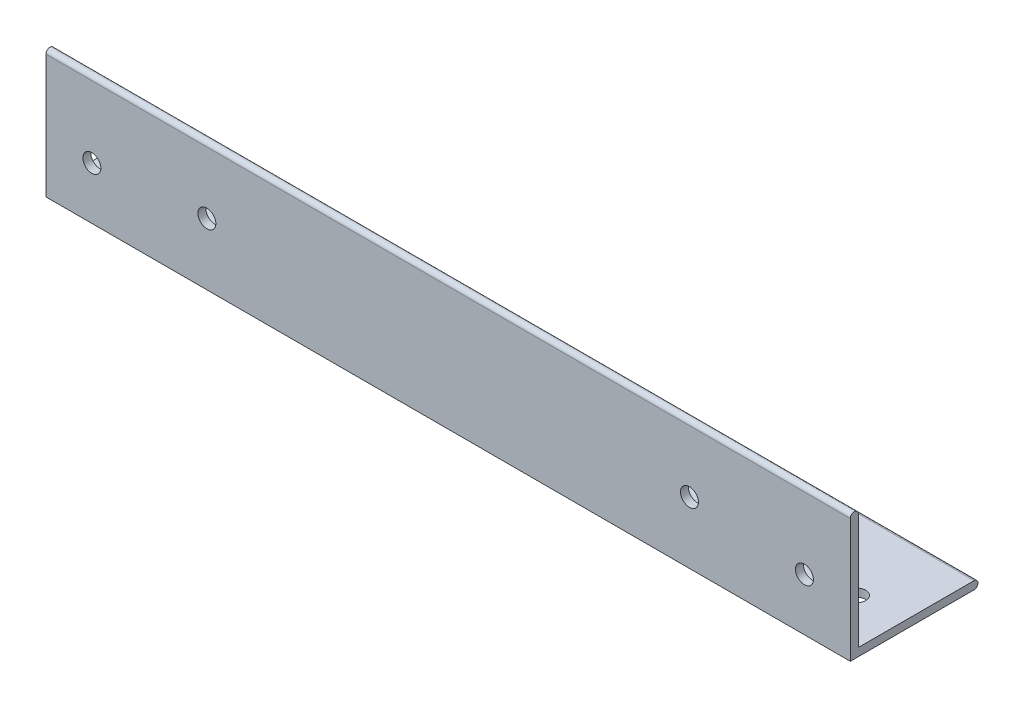
ISO-10303-21;
HEADER;
FILE_DESCRIPTION(('STEP AP214'),'2;1');
FILE_NAME('part.step','',(''),(''),'','','');
FILE_SCHEMA(('AUTOMOTIVE_DESIGN { 1 0 10303 214 1 1 1 1 }'));
ENDSEC;
DATA;
#1=APPLICATION_CONTEXT('core data for automotive mechanical design processes');
#2=APPLICATION_PROTOCOL_DEFINITION('international standard','automotive_design',2000,#1);
#3=PRODUCT_CONTEXT('',#1,'mechanical');
#4=PRODUCT('Part','Part','',(#3));
#5=PRODUCT_RELATED_PRODUCT_CATEGORY('part','',(#4));
#6=PRODUCT_DEFINITION_FORMATION('','',#4);
#7=PRODUCT_DEFINITION_CONTEXT('part definition',#1,'design');
#8=PRODUCT_DEFINITION('design','',#6,#7);
#9=PRODUCT_DEFINITION_SHAPE('','',#8);
#10=(LENGTH_UNIT() NAMED_UNIT(*) SI_UNIT(.MILLI.,.METRE.));
#11=(NAMED_UNIT(*) PLANE_ANGLE_UNIT() SI_UNIT($,.RADIAN.));
#12=(NAMED_UNIT(*) SI_UNIT($,.STERADIAN.) SOLID_ANGLE_UNIT());
#13=UNCERTAINTY_MEASURE_WITH_UNIT(LENGTH_MEASURE(1.E-05),#10,'distance_accuracy_value','');
#14=(GEOMETRIC_REPRESENTATION_CONTEXT(3) GLOBAL_UNCERTAINTY_ASSIGNED_CONTEXT((#13)) GLOBAL_UNIT_ASSIGNED_CONTEXT((#10,
#11,#12)) REPRESENTATION_CONTEXT('',''));
#15=CARTESIAN_POINT('',(0.,0.,0.));
#16=DIRECTION('',(0.,0.,1.));
#17=DIRECTION('',(1.,0.,0.));
#18=AXIS2_PLACEMENT_3D('',#15,#16,#17);
#19=CARTESIAN_POINT('',(160.,0.793749999999999,-24.60625));
#20=DIRECTION('',(-1.,0.,0.));
#21=DIRECTION('',(0.,0.,1.));
#22=AXIS2_PLACEMENT_3D('',#19,#20,#21);
#23=CYLINDRICAL_SURFACE('',#22,0.793749999999999);
#24=DIRECTION('',(-1.,0.,0.));
#25=VECTOR('',#24,1.);
#26=CARTESIAN_POINT('',(160.,1.5875,-24.60625));
#27=LINE('',#26,#25);
#28=CARTESIAN_POINT('',(160.,1.5875,-24.60625));
#29=VERTEX_POINT('',#28);
#30=CARTESIAN_POINT('',(0.,1.5875,-24.60625));
#31=VERTEX_POINT('',#30);
#32=EDGE_CURVE('E138',#29,#31,#27,.T.);
#33=ORIENTED_EDGE('',*,*,#32,.F.);
#34=CARTESIAN_POINT('',(160.,0.793749999999999,-24.60625));
#35=DIRECTION('',(-1.,0.,0.));
#36=DIRECTION('',(0.,0.,1.));
#37=AXIS2_PLACEMENT_3D('',#34,#35,#36);
#38=CIRCLE('',#37,0.793749999999999);
#39=CARTESIAN_POINT('',(160.,0.,-24.60625));
#40=VERTEX_POINT('',#39);
#41=EDGE_CURVE('E47',#40,#29,#38,.F.);
#42=ORIENTED_EDGE('',*,*,#41,.F.);
#43=DIRECTION('',(-1.,0.,0.));
#44=VECTOR('',#43,1.);
#45=CARTESIAN_POINT('',(160.,0.,-24.60625));
#46=LINE('',#45,#44);
#47=CARTESIAN_POINT('',(0.,0.,-24.60625));
#48=VERTEX_POINT('',#47);
#49=EDGE_CURVE('E140',#48,#40,#46,.F.);
#50=ORIENTED_EDGE('',*,*,#49,.F.);
#51=CARTESIAN_POINT('',(0.,0.793749999999999,-24.60625));
#52=DIRECTION('',(-1.,0.,0.));
#53=DIRECTION('',(0.,0.,1.));
#54=AXIS2_PLACEMENT_3D('',#51,#52,#53);
#55=CIRCLE('',#54,0.793749999999999);
#56=EDGE_CURVE('E11',#31,#48,#55,.T.);
#57=ORIENTED_EDGE('',*,*,#56,.F.);
#58=EDGE_LOOP('',(#33,#42,#50,#57));
#59=FACE_BOUND('',#58,.T.);
#60=ADVANCED_FACE('F38',(#59),#23,.T.);
#61=CARTESIAN_POINT('',(160.,24.60625,-0.79375));
#62=DIRECTION('',(-1.,0.,0.));
#63=DIRECTION('',(0.,0.,1.));
#64=AXIS2_PLACEMENT_3D('',#61,#62,#63);
#65=CYLINDRICAL_SURFACE('',#64,0.79375);
#66=DIRECTION('',(-1.,0.,0.));
#67=VECTOR('',#66,1.);
#68=CARTESIAN_POINT('',(160.,24.60625,0.));
#69=LINE('',#68,#67);
#70=CARTESIAN_POINT('',(160.,24.60625,0.));
#71=VERTEX_POINT('',#70);
#72=CARTESIAN_POINT('',(0.,24.60625,0.));
#73=VERTEX_POINT('',#72);
#74=EDGE_CURVE('E108',#71,#73,#69,.T.);
#75=ORIENTED_EDGE('',*,*,#74,.F.);
#76=CARTESIAN_POINT('',(160.,24.60625,-0.79375));
#77=DIRECTION('',(-1.,0.,0.));
#78=DIRECTION('',(0.,0.,1.));
#79=AXIS2_PLACEMENT_3D('',#76,#77,#78);
#80=CIRCLE('',#79,0.79375);
#81=CARTESIAN_POINT('',(160.,24.60625,-1.5875));
#82=VERTEX_POINT('',#81);
#83=EDGE_CURVE('E134',#82,#71,#80,.F.);
#84=ORIENTED_EDGE('',*,*,#83,.F.);
#85=DIRECTION('',(-1.,0.,0.));
#86=VECTOR('',#85,1.);
#87=CARTESIAN_POINT('',(160.,24.60625,-1.5875));
#88=LINE('',#87,#86);
#89=CARTESIAN_POINT('',(0.,24.60625,-1.5875));
#90=VERTEX_POINT('',#89);
#91=EDGE_CURVE('E114',#90,#82,#88,.F.);
#92=ORIENTED_EDGE('',*,*,#91,.F.);
#93=CARTESIAN_POINT('',(0.,24.60625,-0.79375));
#94=DIRECTION('',(-1.,0.,0.));
#95=DIRECTION('',(0.,0.,1.));
#96=AXIS2_PLACEMENT_3D('',#93,#94,#95);
#97=CIRCLE('',#96,0.79375);
#98=EDGE_CURVE('E136',#73,#90,#97,.T.);
#99=ORIENTED_EDGE('',*,*,#98,.F.);
#100=EDGE_LOOP('',(#75,#84,#92,#99));
#101=FACE_BOUND('',#100,.T.);
#102=ADVANCED_FACE('F199',(#101),#65,.T.);
#103=CARTESIAN_POINT('',(160.,0.,-25.4));
#104=DIRECTION('',(0.,1.,0.));
#105=DIRECTION('',(0.,0.,1.));
#106=AXIS2_PLACEMENT_3D('',#103,#104,#105);
#107=PLANE('',#106);
#108=CARTESIAN_POINT('',(50.05,0.,-10.915));
#109=DIRECTION('',(0.,-1.,0.));
#110=DIRECTION('',(0.,0.,-1.));
#111=AXIS2_PLACEMENT_3D('',#108,#109,#110);
#112=CIRCLE('',#111,2.38125);
#113=CARTESIAN_POINT('',(50.05,0.,-13.29625));
#114=VERTEX_POINT('',#113);
#115=EDGE_CURVE('E150',#114,#114,#112,.T.);
#116=ORIENTED_EDGE('',*,*,#115,.F.);
#117=EDGE_LOOP('',(#116));
#118=FACE_BOUND('',#117,.T.);
#119=CARTESIAN_POINT('',(109.95,0.,-10.915));
#120=DIRECTION('',(0.,-1.,0.));
#121=DIRECTION('',(0.,0.,-1.));
#122=AXIS2_PLACEMENT_3D('',#119,#120,#121);
#123=CIRCLE('',#122,2.38125000000001);
#124=CARTESIAN_POINT('',(109.95,0.,-13.29625));
#125=VERTEX_POINT('',#124);
#126=EDGE_CURVE('E156',#125,#125,#123,.T.);
#127=ORIENTED_EDGE('',*,*,#126,.F.);
#128=EDGE_LOOP('',(#127));
#129=FACE_BOUND('',#128,.T.);
#130=CARTESIAN_POINT('',(9.13,0.,-10.41));
#131=DIRECTION('',(0.,-1.,0.));
#132=DIRECTION('',(0.,0.,1.));
#133=AXIS2_PLACEMENT_3D('',#130,#131,#132);
#134=CIRCLE('',#133,1.785);
#135=CARTESIAN_POINT('',(9.13,0.,-8.625));
#136=VERTEX_POINT('',#135);
#137=EDGE_CURVE('E146',#136,#136,#134,.T.);
#138=ORIENTED_EDGE('',*,*,#137,.F.);
#139=EDGE_LOOP('',(#138));
#140=FACE_BOUND('',#139,.T.);
#141=CARTESIAN_POINT('',(150.87,0.,-10.41));
#142=DIRECTION('',(0.,-1.,0.));
#143=DIRECTION('',(0.,0.,-1.));
#144=AXIS2_PLACEMENT_3D('',#141,#142,#143);
#145=CIRCLE('',#144,1.78500000000001);
#146=CARTESIAN_POINT('',(150.87,0.,-12.195));
#147=VERTEX_POINT('',#146);
#148=EDGE_CURVE('E184',#147,#147,#145,.T.);
#149=ORIENTED_EDGE('',*,*,#148,.F.);
#150=EDGE_LOOP('',(#149));
#151=FACE_BOUND('',#150,.T.);
#152=DIRECTION('',(0.,0.,-1.));
#153=VECTOR('',#152,1.);
#154=CARTESIAN_POINT('',(0.,0.,-25.4));
#155=LINE('',#154,#153);
#156=CARTESIAN_POINT('',(0.,0.,0.));
#157=VERTEX_POINT('',#156);
#158=EDGE_CURVE('E120',#157,#48,#155,.T.);
#159=ORIENTED_EDGE('',*,*,#158,.T.);
#160=ORIENTED_EDGE('',*,*,#49,.T.);
#161=DIRECTION('',(0.,0.,-1.));
#162=VECTOR('',#161,1.);
#163=CARTESIAN_POINT('',(160.,0.,-25.4));
#164=LINE('',#163,#162);
#165=CARTESIAN_POINT('',(160.,0.,0.));
#166=VERTEX_POINT('',#165);
#167=EDGE_CURVE('E99',#166,#40,#164,.T.);
#168=ORIENTED_EDGE('',*,*,#167,.F.);
#169=DIRECTION('',(-1.,0.,0.));
#170=VECTOR('',#169,1.);
#171=CARTESIAN_POINT('',(160.,0.,0.));
#172=LINE('',#171,#170);
#173=EDGE_CURVE('E109',#166,#157,#172,.T.);
#174=ORIENTED_EDGE('',*,*,#173,.T.);
#175=EDGE_LOOP('',(#159,#160,#168,#174));
#176=FACE_BOUND('',#175,.T.);
#177=ADVANCED_FACE('F194',(#118,#129,#140,#151,#176),#107,.F.);
#178=CARTESIAN_POINT('',(160.,1.5875,-1.5875));
#179=DIRECTION('',(0.,-1.,0.));
#180=DIRECTION('',(0.,0.,-1.));
#181=AXIS2_PLACEMENT_3D('',#178,#179,#180);
#182=PLANE('',#181);
#183=CARTESIAN_POINT('',(50.05,1.5875,-10.915));
#184=DIRECTION('',(0.,-1.,0.));
#185=DIRECTION('',(0.,0.,-1.));
#186=AXIS2_PLACEMENT_3D('',#183,#184,#185);
#187=CIRCLE('',#186,2.38125);
#188=CARTESIAN_POINT('',(50.05,1.5875,-13.29625));
#189=VERTEX_POINT('',#188);
#190=EDGE_CURVE('E42',#189,#189,#187,.T.);
#191=ORIENTED_EDGE('',*,*,#190,.T.);
#192=EDGE_LOOP('',(#191));
#193=FACE_BOUND('',#192,.T.);
#194=CARTESIAN_POINT('',(109.95,1.5875,-10.915));
#195=DIRECTION('',(0.,-1.,0.));
#196=DIRECTION('',(0.,0.,-1.));
#197=AXIS2_PLACEMENT_3D('',#194,#195,#196);
#198=CIRCLE('',#197,2.38125000000001);
#199=CARTESIAN_POINT('',(109.95,1.5875,-13.29625));
#200=VERTEX_POINT('',#199);
#201=EDGE_CURVE('E148',#200,#200,#198,.T.);
#202=ORIENTED_EDGE('',*,*,#201,.T.);
#203=EDGE_LOOP('',(#202));
#204=FACE_BOUND('',#203,.T.);
#205=CARTESIAN_POINT('',(9.13,1.5875,-10.41));
#206=DIRECTION('',(0.,-1.,0.));
#207=DIRECTION('',(0.,0.,-1.));
#208=AXIS2_PLACEMENT_3D('',#205,#206,#207);
#209=CIRCLE('',#208,1.785);
#210=CARTESIAN_POINT('',(9.13,1.5875,-12.195));
#211=VERTEX_POINT('',#210);
#212=EDGE_CURVE('E123',#211,#211,#209,.T.);
#213=ORIENTED_EDGE('',*,*,#212,.T.);
#214=EDGE_LOOP('',(#213));
#215=FACE_BOUND('',#214,.T.);
#216=CARTESIAN_POINT('',(150.87,1.5875,-10.41));
#217=DIRECTION('',(0.,-1.,0.));
#218=DIRECTION('',(0.,0.,-1.));
#219=AXIS2_PLACEMENT_3D('',#216,#217,#218);
#220=CIRCLE('',#219,1.78500000000001);
#221=CARTESIAN_POINT('',(150.87,1.5875,-12.195));
#222=VERTEX_POINT('',#221);
#223=EDGE_CURVE('E143',#222,#222,#220,.T.);
#224=ORIENTED_EDGE('',*,*,#223,.T.);
#225=EDGE_LOOP('',(#224));
#226=FACE_BOUND('',#225,.T.);
#227=DIRECTION('',(0.,0.,1.));
#228=VECTOR('',#227,1.);
#229=CARTESIAN_POINT('',(160.,1.5875,-1.5875));
#230=LINE('',#229,#228);
#231=CARTESIAN_POINT('',(160.,1.5875,-1.5875));
#232=VERTEX_POINT('',#231);
#233=EDGE_CURVE('E91',#29,#232,#230,.T.);
#234=ORIENTED_EDGE('',*,*,#233,.F.);
#235=ORIENTED_EDGE('',*,*,#32,.T.);
#236=DIRECTION('',(0.,0.,1.));
#237=VECTOR('',#236,1.);
#238=CARTESIAN_POINT('',(0.,1.5875,-1.5875));
#239=LINE('',#238,#237);
#240=CARTESIAN_POINT('',(0.,1.5875,-1.5875));
#241=VERTEX_POINT('',#240);
#242=EDGE_CURVE('E104',#31,#241,#239,.T.);
#243=ORIENTED_EDGE('',*,*,#242,.T.);
#244=DIRECTION('',(-1.,0.,0.));
#245=VECTOR('',#244,1.);
#246=CARTESIAN_POINT('',(160.,1.5875,-1.5875));
#247=LINE('',#246,#245);
#248=EDGE_CURVE('E102',#232,#241,#247,.T.);
#249=ORIENTED_EDGE('',*,*,#248,.F.);
#250=EDGE_LOOP('',(#234,#235,#243,#249));
#251=FACE_BOUND('',#250,.T.);
#252=ADVANCED_FACE('F103',(#193,#204,#215,#226,#251),#182,.F.);
#253=CARTESIAN_POINT('',(160.,25.4,-1.5875));
#254=DIRECTION('',(0.,0.,1.));
#255=DIRECTION('',(0.,-1.,0.));
#256=AXIS2_PLACEMENT_3D('',#253,#254,#255);
#257=PLANE('',#256);
#258=CARTESIAN_POINT('',(32.,12.303125,-1.5875));
#259=DIRECTION('',(0.,0.,1.));
#260=DIRECTION('',(0.,-1.,0.));
#261=AXIS2_PLACEMENT_3D('',#258,#259,#260);
#262=CIRCLE('',#261,1.785);
#263=CARTESIAN_POINT('',(32.,10.518125,-1.5875));
#264=VERTEX_POINT('',#263);
#265=EDGE_CURVE('E171',#264,#264,#262,.T.);
#266=ORIENTED_EDGE('',*,*,#265,.T.);
#267=EDGE_LOOP('',(#266));
#268=FACE_BOUND('',#267,.T.);
#269=CARTESIAN_POINT('',(127.999999999999,12.303125,-1.5875));
#270=DIRECTION('',(0.,0.,1.));
#271=DIRECTION('',(0.,-1.,0.));
#272=AXIS2_PLACEMENT_3D('',#269,#270,#271);
#273=CIRCLE('',#272,1.78500000000001);
#274=CARTESIAN_POINT('',(127.999999999999,10.518125,-1.5875));
#275=VERTEX_POINT('',#274);
#276=EDGE_CURVE('E166',#275,#275,#273,.T.);
#277=ORIENTED_EDGE('',*,*,#276,.T.);
#278=EDGE_LOOP('',(#277));
#279=FACE_BOUND('',#278,.T.);
#280=CARTESIAN_POINT('',(9.13,10.41,-1.5875));
#281=DIRECTION('',(0.,0.,1.));
#282=DIRECTION('',(0.,1.,0.));
#283=AXIS2_PLACEMENT_3D('',#280,#281,#282);
#284=CIRCLE('',#283,1.78500000000001);
#285=CARTESIAN_POINT('',(9.13,12.195,-1.5875));
#286=VERTEX_POINT('',#285);
#287=EDGE_CURVE('E174',#286,#286,#284,.T.);
#288=ORIENTED_EDGE('',*,*,#287,.T.);
#289=EDGE_LOOP('',(#288));
#290=FACE_BOUND('',#289,.T.);
#291=CARTESIAN_POINT('',(150.87,10.41,-1.5875));
#292=DIRECTION('',(0.,0.,-1.));
#293=DIRECTION('',(0.,1.,0.));
#294=AXIS2_PLACEMENT_3D('',#291,#292,#293);
#295=CIRCLE('',#294,1.78500000000001);
#296=CARTESIAN_POINT('',(150.87,12.195,-1.5875));
#297=VERTEX_POINT('',#296);
#298=EDGE_CURVE('E178',#297,#297,#295,.T.);
#299=ORIENTED_EDGE('',*,*,#298,.F.);
#300=EDGE_LOOP('',(#299));
#301=FACE_BOUND('',#300,.T.);
#302=DIRECTION('',(0.,1.,0.));
#303=VECTOR('',#302,1.);
#304=CARTESIAN_POINT('',(0.,25.4,-1.5875));
#305=LINE('',#304,#303);
#306=EDGE_CURVE('E125',#241,#90,#305,.T.);
#307=ORIENTED_EDGE('',*,*,#306,.T.);
#308=ORIENTED_EDGE('',*,*,#91,.T.);
#309=DIRECTION('',(0.,1.,0.));
#310=VECTOR('',#309,1.);
#311=CARTESIAN_POINT('',(160.,25.4,-1.5875));
#312=LINE('',#311,#310);
#313=EDGE_CURVE('E96',#232,#82,#312,.T.);
#314=ORIENTED_EDGE('',*,*,#313,.F.);
#315=ORIENTED_EDGE('',*,*,#248,.T.);
#316=EDGE_LOOP('',(#307,#308,#314,#315));
#317=FACE_BOUND('',#316,.T.);
#318=ADVANCED_FACE('F112',(#268,#279,#290,#301,#317),#257,.F.);
#319=CARTESIAN_POINT('',(160.,0.,0.));
#320=DIRECTION('',(0.,0.,-1.));
#321=DIRECTION('',(-1.,0.,0.));
#322=AXIS2_PLACEMENT_3D('',#319,#320,#321);
#323=PLANE('',#322);
#324=CARTESIAN_POINT('',(32.,12.303125,0.));
#325=DIRECTION('',(0.,0.,1.));
#326=DIRECTION('',(1.,0.,0.));
#327=AXIS2_PLACEMENT_3D('',#324,#325,#326);
#328=CIRCLE('',#327,1.785);
#329=CARTESIAN_POINT('',(33.785,12.303125,0.));
#330=VERTEX_POINT('',#329);
#331=EDGE_CURVE('E163',#330,#330,#328,.T.);
#332=ORIENTED_EDGE('',*,*,#331,.F.);
#333=EDGE_LOOP('',(#332));
#334=FACE_BOUND('',#333,.T.);
#335=CARTESIAN_POINT('',(127.999999999999,12.303125,0.));
#336=DIRECTION('',(0.,0.,1.));
#337=DIRECTION('',(1.,0.,0.));
#338=AXIS2_PLACEMENT_3D('',#335,#336,#337);
#339=CIRCLE('',#338,1.78500000000001);
#340=CARTESIAN_POINT('',(129.784999999999,12.303125,0.));
#341=VERTEX_POINT('',#340);
#342=EDGE_CURVE('E154',#341,#341,#339,.T.);
#343=ORIENTED_EDGE('',*,*,#342,.F.);
#344=EDGE_LOOP('',(#343));
#345=FACE_BOUND('',#344,.T.);
#346=CARTESIAN_POINT('',(9.13,10.41,0.));
#347=DIRECTION('',(0.,0.,1.));
#348=DIRECTION('',(0.,1.,0.));
#349=AXIS2_PLACEMENT_3D('',#346,#347,#348);
#350=CIRCLE('',#349,1.78500000000001);
#351=CARTESIAN_POINT('',(9.13,12.195,0.));
#352=VERTEX_POINT('',#351);
#353=EDGE_CURVE('E175',#352,#352,#350,.T.);
#354=ORIENTED_EDGE('',*,*,#353,.F.);
#355=EDGE_LOOP('',(#354));
#356=FACE_BOUND('',#355,.T.);
#357=CARTESIAN_POINT('',(150.87,10.41,0.));
#358=DIRECTION('',(0.,0.,-1.));
#359=DIRECTION('',(0.,1.,0.));
#360=AXIS2_PLACEMENT_3D('',#357,#358,#359);
#361=CIRCLE('',#360,1.78500000000001);
#362=CARTESIAN_POINT('',(150.87,12.195,0.));
#363=VERTEX_POINT('',#362);
#364=EDGE_CURVE('E181',#363,#363,#361,.T.);
#365=ORIENTED_EDGE('',*,*,#364,.T.);
#366=EDGE_LOOP('',(#365));
#367=FACE_BOUND('',#366,.T.);
#368=DIRECTION('',(0.,-1.,0.));
#369=VECTOR('',#368,1.);
#370=CARTESIAN_POINT('',(160.,0.,0.));
#371=LINE('',#370,#369);
#372=EDGE_CURVE('E115',#71,#166,#371,.T.);
#373=ORIENTED_EDGE('',*,*,#372,.F.);
#374=ORIENTED_EDGE('',*,*,#74,.T.);
#375=DIRECTION('',(0.,-1.,0.));
#376=VECTOR('',#375,1.);
#377=CARTESIAN_POINT('',(0.,0.,0.));
#378=LINE('',#377,#376);
#379=EDGE_CURVE('E127',#73,#157,#378,.T.);
#380=ORIENTED_EDGE('',*,*,#379,.T.);
#381=ORIENTED_EDGE('',*,*,#173,.F.);
#382=EDGE_LOOP('',(#373,#374,#380,#381));
#383=FACE_BOUND('',#382,.T.);
#384=ADVANCED_FACE('F201',(#334,#345,#356,#367,#383),#323,.F.);
#385=CARTESIAN_POINT('',(160.,0.,0.));
#386=DIRECTION('',(-1.,0.,0.));
#387=DIRECTION('',(0.,0.,1.));
#388=AXIS2_PLACEMENT_3D('',#385,#386,#387);
#389=PLANE('',#388);
#390=ORIENTED_EDGE('',*,*,#167,.T.);
#391=ORIENTED_EDGE('',*,*,#41,.T.);
#392=ORIENTED_EDGE('',*,*,#233,.T.);
#393=ORIENTED_EDGE('',*,*,#313,.T.);
#394=ORIENTED_EDGE('',*,*,#83,.T.);
#395=ORIENTED_EDGE('',*,*,#372,.T.);
#396=EDGE_LOOP('',(#390,#391,#392,#393,#394,#395));
#397=FACE_BOUND('',#396,.T.);
#398=ADVANCED_FACE('F94',(#397),#389,.F.);
#399=CARTESIAN_POINT('',(0.,0.,0.));
#400=DIRECTION('',(-1.,0.,0.));
#401=DIRECTION('',(0.,0.,1.));
#402=AXIS2_PLACEMENT_3D('',#399,#400,#401);
#403=PLANE('',#402);
#404=ORIENTED_EDGE('',*,*,#242,.F.);
#405=ORIENTED_EDGE('',*,*,#56,.T.);
#406=ORIENTED_EDGE('',*,*,#158,.F.);
#407=ORIENTED_EDGE('',*,*,#379,.F.);
#408=ORIENTED_EDGE('',*,*,#98,.T.);
#409=ORIENTED_EDGE('',*,*,#306,.F.);
#410=EDGE_LOOP('',(#404,#405,#406,#407,#408,#409));
#411=FACE_BOUND('',#410,.T.);
#412=ADVANCED_FACE('F195',(#411),#403,.T.);
#413=CARTESIAN_POINT('',(150.87,25.4,-10.41));
#414=DIRECTION('',(0.,-1.,0.));
#415=DIRECTION('',(0.,0.,-1.));
#416=AXIS2_PLACEMENT_3D('',#413,#414,#415);
#417=CYLINDRICAL_SURFACE('',#416,1.78500000000001);
#418=ORIENTED_EDGE('',*,*,#148,.T.);
#419=EDGE_LOOP('',(#418));
#420=FACE_BOUND('',#419,.T.);
#421=ORIENTED_EDGE('',*,*,#223,.F.);
#422=EDGE_LOOP('',(#421));
#423=FACE_BOUND('',#422,.T.);
#424=ADVANCED_FACE('F238',(#420,#423),#417,.F.);
#425=CARTESIAN_POINT('',(9.13,25.4,-10.41));
#426=DIRECTION('',(0.,-1.,0.));
#427=DIRECTION('',(0.,0.,-1.));
#428=AXIS2_PLACEMENT_3D('',#425,#426,#427);
#429=CYLINDRICAL_SURFACE('',#428,1.785);
#430=ORIENTED_EDGE('',*,*,#137,.T.);
#431=EDGE_LOOP('',(#430));
#432=FACE_BOUND('',#431,.T.);
#433=ORIENTED_EDGE('',*,*,#212,.F.);
#434=EDGE_LOOP('',(#433));
#435=FACE_BOUND('',#434,.T.);
#436=ADVANCED_FACE('F240',(#432,#435),#429,.F.);
#437=CARTESIAN_POINT('',(150.87,10.41,0.));
#438=DIRECTION('',(0.,0.,-1.));
#439=DIRECTION('',(0.,1.,0.));
#440=AXIS2_PLACEMENT_3D('',#437,#438,#439);
#441=CYLINDRICAL_SURFACE('',#440,1.78500000000001);
#442=ORIENTED_EDGE('',*,*,#364,.F.);
#443=EDGE_LOOP('',(#442));
#444=FACE_BOUND('',#443,.T.);
#445=ORIENTED_EDGE('',*,*,#298,.T.);
#446=EDGE_LOOP('',(#445));
#447=FACE_BOUND('',#446,.T.);
#448=ADVANCED_FACE('F247',(#444,#447),#441,.F.);
#449=CARTESIAN_POINT('',(9.13,10.41,0.));
#450=DIRECTION('',(0.,0.,-1.));
#451=DIRECTION('',(0.,1.,0.));
#452=AXIS2_PLACEMENT_3D('',#449,#450,#451);
#453=CYLINDRICAL_SURFACE('',#452,1.78500000000001);
#454=ORIENTED_EDGE('',*,*,#353,.T.);
#455=EDGE_LOOP('',(#454));
#456=FACE_BOUND('',#455,.T.);
#457=ORIENTED_EDGE('',*,*,#287,.F.);
#458=EDGE_LOOP('',(#457));
#459=FACE_BOUND('',#458,.T.);
#460=ADVANCED_FACE('F253',(#456,#459),#453,.F.);
#461=CARTESIAN_POINT('',(127.999999999999,12.303125,-10.));
#462=DIRECTION('',(0.,0.,1.));
#463=DIRECTION('',(1.,0.,0.));
#464=AXIS2_PLACEMENT_3D('',#461,#462,#463);
#465=CYLINDRICAL_SURFACE('',#464,1.78500000000001);
#466=ORIENTED_EDGE('',*,*,#342,.T.);
#467=EDGE_LOOP('',(#466));
#468=FACE_BOUND('',#467,.T.);
#469=ORIENTED_EDGE('',*,*,#276,.F.);
#470=EDGE_LOOP('',(#469));
#471=FACE_BOUND('',#470,.T.);
#472=ADVANCED_FACE('F257',(#468,#471),#465,.F.);
#473=CARTESIAN_POINT('',(32.,12.303125,-10.));
#474=DIRECTION('',(0.,0.,1.));
#475=DIRECTION('',(1.,0.,0.));
#476=AXIS2_PLACEMENT_3D('',#473,#474,#475);
#477=CYLINDRICAL_SURFACE('',#476,1.785);
#478=ORIENTED_EDGE('',*,*,#331,.T.);
#479=EDGE_LOOP('',(#478));
#480=FACE_BOUND('',#479,.T.);
#481=ORIENTED_EDGE('',*,*,#265,.F.);
#482=EDGE_LOOP('',(#481));
#483=FACE_BOUND('',#482,.T.);
#484=ADVANCED_FACE('F261',(#480,#483),#477,.F.);
#485=CARTESIAN_POINT('',(109.95,10.,-10.915));
#486=DIRECTION('',(0.,-1.,0.));
#487=DIRECTION('',(0.,0.,-1.));
#488=AXIS2_PLACEMENT_3D('',#485,#486,#487);
#489=CYLINDRICAL_SURFACE('',#488,2.38125000000001);
#490=ORIENTED_EDGE('',*,*,#126,.T.);
#491=EDGE_LOOP('',(#490));
#492=FACE_BOUND('',#491,.T.);
#493=ORIENTED_EDGE('',*,*,#201,.F.);
#494=EDGE_LOOP('',(#493));
#495=FACE_BOUND('',#494,.T.);
#496=ADVANCED_FACE('F265',(#492,#495),#489,.F.);
#497=CARTESIAN_POINT('',(50.05,10.,-10.915));
#498=DIRECTION('',(0.,-1.,0.));
#499=DIRECTION('',(0.,0.,-1.));
#500=AXIS2_PLACEMENT_3D('',#497,#498,#499);
#501=CYLINDRICAL_SURFACE('',#500,2.38125);
#502=ORIENTED_EDGE('',*,*,#115,.T.);
#503=EDGE_LOOP('',(#502));
#504=FACE_BOUND('',#503,.T.);
#505=ORIENTED_EDGE('',*,*,#190,.F.);
#506=EDGE_LOOP('',(#505));
#507=FACE_BOUND('',#506,.T.);
#508=ADVANCED_FACE('F269',(#504,#507),#501,.F.);
#509=CLOSED_SHELL('',(#60,#102,#177,#252,#318,#384,#398,#412,#424,#436,#448,#460,#472,#484,#496,#508));
#510=MANIFOLD_SOLID_BREP('B2',#509);
#511=ADVANCED_BREP_SHAPE_REPRESENTATION('',(#18,#510),#14);
#512=SHAPE_DEFINITION_REPRESENTATION(#9,#511);
ENDSEC;
END-ISO-10303-21;
